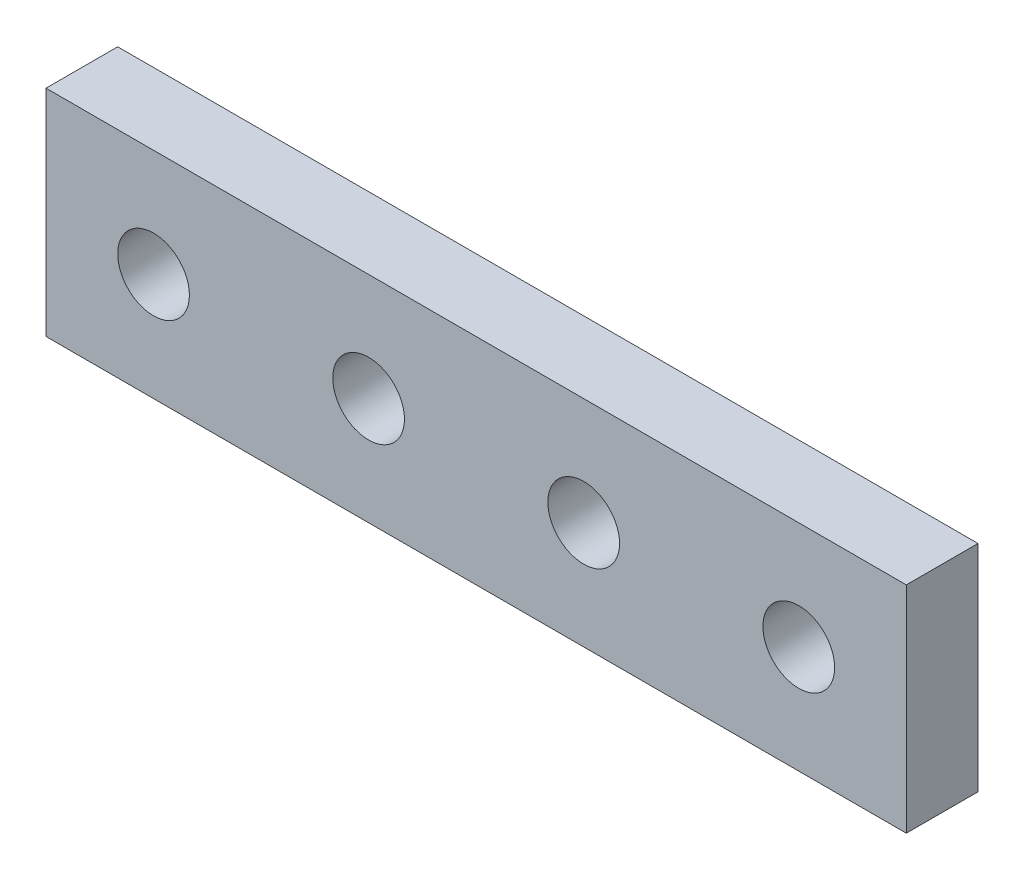
ISO-10303-21;
HEADER;
FILE_DESCRIPTION(('STEP AP214'),'2;1');
FILE_NAME('part.step','',(''),(''),'','','');
FILE_SCHEMA(('AUTOMOTIVE_DESIGN { 1 0 10303 214 1 1 1 1 }'));
ENDSEC;
DATA;
#1=APPLICATION_CONTEXT('core data for automotive mechanical design processes');
#2=APPLICATION_PROTOCOL_DEFINITION('international standard','automotive_design',2000,#1);
#3=PRODUCT_CONTEXT('',#1,'mechanical');
#4=PRODUCT('Part','Part','',(#3));
#5=PRODUCT_RELATED_PRODUCT_CATEGORY('part','',(#4));
#6=PRODUCT_DEFINITION_FORMATION('','',#4);
#7=PRODUCT_DEFINITION_CONTEXT('part definition',#1,'design');
#8=PRODUCT_DEFINITION('design','',#6,#7);
#9=PRODUCT_DEFINITION_SHAPE('','',#8);
#10=(LENGTH_UNIT() NAMED_UNIT(*) SI_UNIT(.MILLI.,.METRE.));
#11=(NAMED_UNIT(*) PLANE_ANGLE_UNIT() SI_UNIT($,.RADIAN.));
#12=(NAMED_UNIT(*) SI_UNIT($,.STERADIAN.) SOLID_ANGLE_UNIT());
#13=UNCERTAINTY_MEASURE_WITH_UNIT(LENGTH_MEASURE(1.E-05),#10,'distance_accuracy_value','');
#14=(GEOMETRIC_REPRESENTATION_CONTEXT(3) GLOBAL_UNCERTAINTY_ASSIGNED_CONTEXT((#13)) GLOBAL_UNIT_ASSIGNED_CONTEXT((#10,
#11,#12)) REPRESENTATION_CONTEXT('',''));
#15=CARTESIAN_POINT('',(0.,0.,0.));
#16=DIRECTION('',(0.,0.,1.));
#17=DIRECTION('',(1.,0.,0.));
#18=AXIS2_PLACEMENT_3D('',#15,#16,#17);
#19=CARTESIAN_POINT('',(0.,0.,10.));
#20=DIRECTION('',(0.,0.,1.));
#21=DIRECTION('',(1.,0.,0.));
#22=AXIS2_PLACEMENT_3D('',#19,#20,#21);
#23=PLANE('',#22);
#24=CARTESIAN_POINT('',(75.,15.,10.));
#25=DIRECTION('',(0.,0.,1.));
#26=DIRECTION('',(1.,0.,0.));
#27=AXIS2_PLACEMENT_3D('',#24,#25,#26);
#28=CIRCLE('',#27,5.);
#29=CARTESIAN_POINT('',(80.,15.,10.));
#30=VERTEX_POINT('',#29);
#31=EDGE_CURVE('E120',#30,#30,#28,.T.);
#32=ORIENTED_EDGE('',*,*,#31,.F.);
#33=EDGE_LOOP('',(#32));
#34=FACE_BOUND('',#33,.T.);
#35=CARTESIAN_POINT('',(15.,15.,10.));
#36=DIRECTION('',(0.,0.,1.));
#37=DIRECTION('',(1.,0.,0.));
#38=AXIS2_PLACEMENT_3D('',#35,#36,#37);
#39=CIRCLE('',#38,5.);
#40=CARTESIAN_POINT('',(20.,15.,10.));
#41=VERTEX_POINT('',#40);
#42=EDGE_CURVE('E99',#41,#41,#39,.T.);
#43=ORIENTED_EDGE('',*,*,#42,.F.);
#44=EDGE_LOOP('',(#43));
#45=FACE_BOUND('',#44,.T.);
#46=DIRECTION('',(0.,-1.,0.));
#47=VECTOR('',#46,1.);
#48=CARTESIAN_POINT('',(0.,30.,10.));
#49=LINE('',#48,#47);
#50=CARTESIAN_POINT('',(0.,30.,10.));
#51=VERTEX_POINT('',#50);
#52=CARTESIAN_POINT('',(0.,0.,10.));
#53=VERTEX_POINT('',#52);
#54=EDGE_CURVE('E84',#51,#53,#49,.T.);
#55=ORIENTED_EDGE('',*,*,#54,.T.);
#56=DIRECTION('',(1.,0.,0.));
#57=VECTOR('',#56,1.);
#58=CARTESIAN_POINT('',(0.,0.,10.));
#59=LINE('',#58,#57);
#60=CARTESIAN_POINT('',(120.,0.,10.));
#61=VERTEX_POINT('',#60);
#62=EDGE_CURVE('E79',#53,#61,#59,.T.);
#63=ORIENTED_EDGE('',*,*,#62,.T.);
#64=DIRECTION('',(0.,1.,0.));
#65=VECTOR('',#64,1.);
#66=CARTESIAN_POINT('',(120.,0.,10.));
#67=LINE('',#66,#65);
#68=CARTESIAN_POINT('',(120.,30.,10.));
#69=VERTEX_POINT('',#68);
#70=EDGE_CURVE('E82',#61,#69,#67,.T.);
#71=ORIENTED_EDGE('',*,*,#70,.T.);
#72=DIRECTION('',(-1.,0.,0.));
#73=VECTOR('',#72,1.);
#74=CARTESIAN_POINT('',(120.,30.,10.));
#75=LINE('',#74,#73);
#76=EDGE_CURVE('E49',#69,#51,#75,.T.);
#77=ORIENTED_EDGE('',*,*,#76,.T.);
#78=EDGE_LOOP('',(#55,#63,#71,#77));
#79=FACE_BOUND('',#78,.T.);
#80=CARTESIAN_POINT('',(45.,15.,10.));
#81=DIRECTION('',(0.,0.,1.));
#82=DIRECTION('',(1.,0.,0.));
#83=AXIS2_PLACEMENT_3D('',#80,#81,#82);
#84=CIRCLE('',#83,5.);
#85=CARTESIAN_POINT('',(50.,15.,10.));
#86=VERTEX_POINT('',#85);
#87=EDGE_CURVE('E114',#86,#86,#84,.T.);
#88=ORIENTED_EDGE('',*,*,#87,.F.);
#89=EDGE_LOOP('',(#88));
#90=FACE_BOUND('',#89,.T.);
#91=CARTESIAN_POINT('',(105.,15.,10.));
#92=DIRECTION('',(0.,0.,1.));
#93=DIRECTION('',(1.,0.,0.));
#94=AXIS2_PLACEMENT_3D('',#91,#92,#93);
#95=CIRCLE('',#94,5.);
#96=CARTESIAN_POINT('',(110.,15.,10.));
#97=VERTEX_POINT('',#96);
#98=EDGE_CURVE('E126',#97,#97,#95,.T.);
#99=ORIENTED_EDGE('',*,*,#98,.F.);
#100=EDGE_LOOP('',(#99));
#101=FACE_BOUND('',#100,.T.);
#102=ADVANCED_FACE('F32',(#34,#45,#79,#90,#101),#23,.T.);
#103=CARTESIAN_POINT('',(0.,0.,0.));
#104=DIRECTION('',(0.,0.,1.));
#105=DIRECTION('',(1.,0.,0.));
#106=AXIS2_PLACEMENT_3D('',#103,#104,#105);
#107=PLANE('',#106);
#108=DIRECTION('',(0.,-1.,0.));
#109=VECTOR('',#108,1.);
#110=CARTESIAN_POINT('',(0.,30.,0.));
#111=LINE('',#110,#109);
#112=CARTESIAN_POINT('',(0.,30.,0.));
#113=VERTEX_POINT('',#112);
#114=CARTESIAN_POINT('',(0.,0.,0.));
#115=VERTEX_POINT('',#114);
#116=EDGE_CURVE('E96',#113,#115,#111,.T.);
#117=ORIENTED_EDGE('',*,*,#116,.F.);
#118=DIRECTION('',(-1.,0.,0.));
#119=VECTOR('',#118,1.);
#120=CARTESIAN_POINT('',(120.,30.,0.));
#121=LINE('',#120,#119);
#122=CARTESIAN_POINT('',(120.,30.,0.));
#123=VERTEX_POINT('',#122);
#124=EDGE_CURVE('E72',#123,#113,#121,.T.);
#125=ORIENTED_EDGE('',*,*,#124,.F.);
#126=DIRECTION('',(0.,1.,0.));
#127=VECTOR('',#126,1.);
#128=CARTESIAN_POINT('',(120.,0.,0.));
#129=LINE('',#128,#127);
#130=CARTESIAN_POINT('',(120.,0.,0.));
#131=VERTEX_POINT('',#130);
#132=EDGE_CURVE('E66',#131,#123,#129,.T.);
#133=ORIENTED_EDGE('',*,*,#132,.F.);
#134=DIRECTION('',(1.,0.,0.));
#135=VECTOR('',#134,1.);
#136=CARTESIAN_POINT('',(0.,0.,0.));
#137=LINE('',#136,#135);
#138=EDGE_CURVE('E88',#115,#131,#137,.T.);
#139=ORIENTED_EDGE('',*,*,#138,.F.);
#140=EDGE_LOOP('',(#117,#125,#133,#139));
#141=FACE_BOUND('',#140,.T.);
#142=CARTESIAN_POINT('',(15.,15.,0.));
#143=DIRECTION('',(0.,0.,1.));
#144=DIRECTION('',(1.,0.,0.));
#145=AXIS2_PLACEMENT_3D('',#142,#143,#144);
#146=CIRCLE('',#145,5.);
#147=CARTESIAN_POINT('',(20.,15.,0.));
#148=VERTEX_POINT('',#147);
#149=EDGE_CURVE('E111',#148,#148,#146,.T.);
#150=ORIENTED_EDGE('',*,*,#149,.T.);
#151=EDGE_LOOP('',(#150));
#152=FACE_BOUND('',#151,.T.);
#153=CARTESIAN_POINT('',(45.,15.,0.));
#154=DIRECTION('',(0.,0.,1.));
#155=DIRECTION('',(1.,0.,0.));
#156=AXIS2_PLACEMENT_3D('',#153,#154,#155);
#157=CIRCLE('',#156,5.);
#158=CARTESIAN_POINT('',(50.,15.,0.));
#159=VERTEX_POINT('',#158);
#160=EDGE_CURVE('E117',#159,#159,#157,.T.);
#161=ORIENTED_EDGE('',*,*,#160,.T.);
#162=EDGE_LOOP('',(#161));
#163=FACE_BOUND('',#162,.T.);
#164=CARTESIAN_POINT('',(75.,15.,0.));
#165=DIRECTION('',(0.,0.,1.));
#166=DIRECTION('',(1.,0.,0.));
#167=AXIS2_PLACEMENT_3D('',#164,#165,#166);
#168=CIRCLE('',#167,5.);
#169=CARTESIAN_POINT('',(80.,15.,0.));
#170=VERTEX_POINT('',#169);
#171=EDGE_CURVE('E123',#170,#170,#168,.T.);
#172=ORIENTED_EDGE('',*,*,#171,.T.);
#173=EDGE_LOOP('',(#172));
#174=FACE_BOUND('',#173,.T.);
#175=CARTESIAN_POINT('',(105.,15.,0.));
#176=DIRECTION('',(0.,0.,1.));
#177=DIRECTION('',(1.,0.,0.));
#178=AXIS2_PLACEMENT_3D('',#175,#176,#177);
#179=CIRCLE('',#178,5.);
#180=CARTESIAN_POINT('',(110.,15.,0.));
#181=VERTEX_POINT('',#180);
#182=EDGE_CURVE('E129',#181,#181,#179,.T.);
#183=ORIENTED_EDGE('',*,*,#182,.T.);
#184=EDGE_LOOP('',(#183));
#185=FACE_BOUND('',#184,.T.);
#186=ADVANCED_FACE('F107',(#141,#152,#163,#174,#185),#107,.F.);
#187=CARTESIAN_POINT('',(0.,30.,10.));
#188=DIRECTION('',(1.,0.,0.));
#189=DIRECTION('',(0.,1.,0.));
#190=AXIS2_PLACEMENT_3D('',#187,#188,#189);
#191=PLANE('',#190);
#192=ORIENTED_EDGE('',*,*,#116,.T.);
#193=DIRECTION('',(0.,0.,-1.));
#194=VECTOR('',#193,1.);
#195=CARTESIAN_POINT('',(0.,0.,10.));
#196=LINE('',#195,#194);
#197=EDGE_CURVE('E11',#53,#115,#196,.T.);
#198=ORIENTED_EDGE('',*,*,#197,.F.);
#199=ORIENTED_EDGE('',*,*,#54,.F.);
#200=DIRECTION('',(0.,0.,-1.));
#201=VECTOR('',#200,1.);
#202=CARTESIAN_POINT('',(0.,30.,10.));
#203=LINE('',#202,#201);
#204=EDGE_CURVE('E92',#51,#113,#203,.T.);
#205=ORIENTED_EDGE('',*,*,#204,.T.);
#206=EDGE_LOOP('',(#192,#198,#199,#205));
#207=FACE_BOUND('',#206,.T.);
#208=ADVANCED_FACE('F34',(#207),#191,.F.);
#209=CARTESIAN_POINT('',(0.,0.,10.));
#210=DIRECTION('',(0.,1.,0.));
#211=DIRECTION('',(0.,0.,1.));
#212=AXIS2_PLACEMENT_3D('',#209,#210,#211);
#213=PLANE('',#212);
#214=ORIENTED_EDGE('',*,*,#138,.T.);
#215=DIRECTION('',(0.,0.,-1.));
#216=VECTOR('',#215,1.);
#217=CARTESIAN_POINT('',(120.,0.,10.));
#218=LINE('',#217,#216);
#219=EDGE_CURVE('E41',#61,#131,#218,.T.);
#220=ORIENTED_EDGE('',*,*,#219,.F.);
#221=ORIENTED_EDGE('',*,*,#62,.F.);
#222=ORIENTED_EDGE('',*,*,#197,.T.);
#223=EDGE_LOOP('',(#214,#220,#221,#222));
#224=FACE_BOUND('',#223,.T.);
#225=ADVANCED_FACE('F87',(#224),#213,.F.);
#226=CARTESIAN_POINT('',(120.,0.,10.));
#227=DIRECTION('',(-1.,0.,0.));
#228=DIRECTION('',(0.,0.,1.));
#229=AXIS2_PLACEMENT_3D('',#226,#227,#228);
#230=PLANE('',#229);
#231=ORIENTED_EDGE('',*,*,#132,.T.);
#232=DIRECTION('',(0.,0.,-1.));
#233=VECTOR('',#232,1.);
#234=CARTESIAN_POINT('',(120.,30.,10.));
#235=LINE('',#234,#233);
#236=EDGE_CURVE('E89',#69,#123,#235,.T.);
#237=ORIENTED_EDGE('',*,*,#236,.F.);
#238=ORIENTED_EDGE('',*,*,#70,.F.);
#239=ORIENTED_EDGE('',*,*,#219,.T.);
#240=EDGE_LOOP('',(#231,#237,#238,#239));
#241=FACE_BOUND('',#240,.T.);
#242=ADVANCED_FACE('F90',(#241),#230,.F.);
#243=CARTESIAN_POINT('',(120.,30.,10.));
#244=DIRECTION('',(0.,-1.,0.));
#245=DIRECTION('',(1.,0.,0.));
#246=AXIS2_PLACEMENT_3D('',#243,#244,#245);
#247=PLANE('',#246);
#248=ORIENTED_EDGE('',*,*,#124,.T.);
#249=ORIENTED_EDGE('',*,*,#204,.F.);
#250=ORIENTED_EDGE('',*,*,#76,.F.);
#251=ORIENTED_EDGE('',*,*,#236,.T.);
#252=EDGE_LOOP('',(#248,#249,#250,#251));
#253=FACE_BOUND('',#252,.T.);
#254=ADVANCED_FACE('F104',(#253),#247,.F.);
#255=CARTESIAN_POINT('',(15.,15.,10.));
#256=DIRECTION('',(0.,0.,-1.));
#257=DIRECTION('',(-1.,0.,0.));
#258=AXIS2_PLACEMENT_3D('',#255,#256,#257);
#259=CYLINDRICAL_SURFACE('',#258,5.);
#260=ORIENTED_EDGE('',*,*,#42,.T.);
#261=EDGE_LOOP('',(#260));
#262=FACE_BOUND('',#261,.T.);
#263=ORIENTED_EDGE('',*,*,#149,.F.);
#264=EDGE_LOOP('',(#263));
#265=FACE_BOUND('',#264,.T.);
#266=ADVANCED_FACE('F148',(#262,#265),#259,.F.);
#267=CARTESIAN_POINT('',(45.,15.,10.));
#268=DIRECTION('',(0.,0.,-1.));
#269=DIRECTION('',(-1.,0.,0.));
#270=AXIS2_PLACEMENT_3D('',#267,#268,#269);
#271=CYLINDRICAL_SURFACE('',#270,5.);
#272=ORIENTED_EDGE('',*,*,#87,.T.);
#273=EDGE_LOOP('',(#272));
#274=FACE_BOUND('',#273,.T.);
#275=ORIENTED_EDGE('',*,*,#160,.F.);
#276=EDGE_LOOP('',(#275));
#277=FACE_BOUND('',#276,.T.);
#278=ADVANCED_FACE('F183',(#274,#277),#271,.F.);
#279=CARTESIAN_POINT('',(75.,15.,10.));
#280=DIRECTION('',(0.,0.,-1.));
#281=DIRECTION('',(-1.,0.,0.));
#282=AXIS2_PLACEMENT_3D('',#279,#280,#281);
#283=CYLINDRICAL_SURFACE('',#282,5.);
#284=ORIENTED_EDGE('',*,*,#31,.T.);
#285=EDGE_LOOP('',(#284));
#286=FACE_BOUND('',#285,.T.);
#287=ORIENTED_EDGE('',*,*,#171,.F.);
#288=EDGE_LOOP('',(#287));
#289=FACE_BOUND('',#288,.T.);
#290=ADVANCED_FACE('F190',(#286,#289),#283,.F.);
#291=CARTESIAN_POINT('',(105.,15.,10.));
#292=DIRECTION('',(0.,0.,-1.));
#293=DIRECTION('',(-1.,0.,0.));
#294=AXIS2_PLACEMENT_3D('',#291,#292,#293);
#295=CYLINDRICAL_SURFACE('',#294,5.);
#296=ORIENTED_EDGE('',*,*,#98,.T.);
#297=EDGE_LOOP('',(#296));
#298=FACE_BOUND('',#297,.T.);
#299=ORIENTED_EDGE('',*,*,#182,.F.);
#300=EDGE_LOOP('',(#299));
#301=FACE_BOUND('',#300,.T.);
#302=ADVANCED_FACE('F135',(#298,#301),#295,.F.);
#303=CLOSED_SHELL('',(#102,#186,#208,#225,#242,#254,#266,#278,#290,#302));
#304=MANIFOLD_SOLID_BREP('B2',#303);
#305=ADVANCED_BREP_SHAPE_REPRESENTATION('',(#18,#304),#14);
#306=SHAPE_DEFINITION_REPRESENTATION(#9,#305);
ENDSEC;
END-ISO-10303-21;
